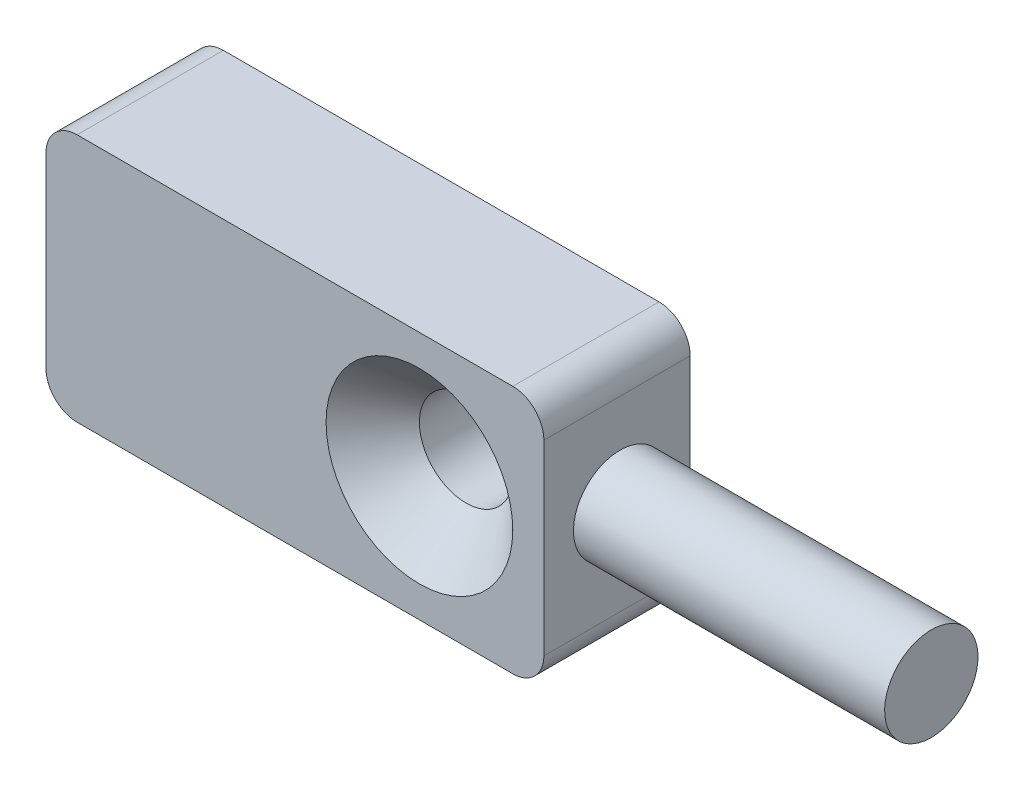
ISO-10303-21;
HEADER;
FILE_DESCRIPTION(('STEP AP214'),'2;1');
FILE_NAME('part.step','',(''),(''),'','','');
FILE_SCHEMA(('AUTOMOTIVE_DESIGN { 1 0 10303 214 1 1 1 1 }'));
ENDSEC;
DATA;
#1=APPLICATION_CONTEXT('core data for automotive mechanical design processes');
#2=APPLICATION_PROTOCOL_DEFINITION('international standard','automotive_design',2000,#1);
#3=PRODUCT_CONTEXT('',#1,'mechanical');
#4=PRODUCT('Part','Part','',(#3));
#5=PRODUCT_RELATED_PRODUCT_CATEGORY('part','',(#4));
#6=PRODUCT_DEFINITION_FORMATION('','',#4);
#7=PRODUCT_DEFINITION_CONTEXT('part definition',#1,'design');
#8=PRODUCT_DEFINITION('design','',#6,#7);
#9=PRODUCT_DEFINITION_SHAPE('','',#8);
#10=(LENGTH_UNIT() NAMED_UNIT(*) SI_UNIT(.MILLI.,.METRE.));
#11=(NAMED_UNIT(*) PLANE_ANGLE_UNIT() SI_UNIT($,.RADIAN.));
#12=(NAMED_UNIT(*) SI_UNIT($,.STERADIAN.) SOLID_ANGLE_UNIT());
#13=UNCERTAINTY_MEASURE_WITH_UNIT(LENGTH_MEASURE(1.E-05),#10,'distance_accuracy_value','');
#14=(GEOMETRIC_REPRESENTATION_CONTEXT(3) GLOBAL_UNCERTAINTY_ASSIGNED_CONTEXT((#13)) GLOBAL_UNIT_ASSIGNED_CONTEXT((#10,
#11,#12)) REPRESENTATION_CONTEXT('',''));
#15=CARTESIAN_POINT('',(0.,0.,0.));
#16=DIRECTION('',(0.,0.,1.));
#17=DIRECTION('',(1.,0.,0.));
#18=AXIS2_PLACEMENT_3D('',#15,#16,#17);
#19=CARTESIAN_POINT('',(0.,4.00000000000002,4.7));
#20=DIRECTION('',(-1.,0.,0.));
#21=DIRECTION('',(0.,-1.,0.));
#22=AXIS2_PLACEMENT_3D('',#19,#20,#21);
#23=PLANE('',#22);
#24=DIRECTION('',(0.,1.,0.));
#25=VECTOR('',#24,1.);
#26=CARTESIAN_POINT('',(0.,4.00000000000002,4.7));
#27=LINE('',#26,#25);
#28=CARTESIAN_POINT('',(0.,-2.99999999999999,4.7));
#29=VERTEX_POINT('',#28);
#30=CARTESIAN_POINT('',(0.,3.00000000000002,4.7));
#31=VERTEX_POINT('',#30);
#32=EDGE_CURVE('E133',#29,#31,#27,.T.);
#33=ORIENTED_EDGE('',*,*,#32,.F.);
#34=DIRECTION('',(0.,0.,-1.));
#35=VECTOR('',#34,1.);
#36=CARTESIAN_POINT('',(0.,-2.99999999999999,4.7));
#37=LINE('',#36,#35);
#38=CARTESIAN_POINT('',(0.,-2.99999999999999,0.));
#39=VERTEX_POINT('',#38);
#40=EDGE_CURVE('E116',#29,#39,#37,.T.);
#41=ORIENTED_EDGE('',*,*,#40,.T.);
#42=DIRECTION('',(0.,1.,0.));
#43=VECTOR('',#42,1.);
#44=CARTESIAN_POINT('',(0.,4.00000000000002,0.));
#45=LINE('',#44,#43);
#46=CARTESIAN_POINT('',(0.,3.00000000000002,0.));
#47=VERTEX_POINT('',#46);
#48=EDGE_CURVE('E130',#39,#47,#45,.T.);
#49=ORIENTED_EDGE('',*,*,#48,.T.);
#50=DIRECTION('',(0.,0.,-1.));
#51=VECTOR('',#50,1.);
#52=CARTESIAN_POINT('',(0.,3.00000000000002,4.7));
#53=LINE('',#52,#51);
#54=EDGE_CURVE('E136',#47,#31,#53,.F.);
#55=ORIENTED_EDGE('',*,*,#54,.T.);
#56=EDGE_LOOP('',(#33,#41,#49,#55));
#57=FACE_BOUND('',#56,.T.);
#58=CARTESIAN_POINT('',(0.,0.,2.25));
#59=DIRECTION('',(-1.,0.,0.));
#60=DIRECTION('',(0.,-1.,0.));
#61=AXIS2_PLACEMENT_3D('',#58,#59,#60);
#62=CIRCLE('',#61,1.5);
#63=CARTESIAN_POINT('',(0.,-1.5,2.25));
#64=VERTEX_POINT('',#63);
#65=EDGE_CURVE('E11',#64,#64,#62,.F.);
#66=ORIENTED_EDGE('',*,*,#65,.F.);
#67=EDGE_LOOP('',(#66));
#68=FACE_BOUND('',#67,.T.);
#69=ADVANCED_FACE('F44',(#57,#68),#23,.F.);
#70=CARTESIAN_POINT('',(0.,-3.99999999999999,4.7));
#71=DIRECTION('',(0.,0.,-1.));
#72=DIRECTION('',(-1.,0.,0.));
#73=AXIS2_PLACEMENT_3D('',#70,#71,#72);
#74=PLANE('',#73);
#75=CARTESIAN_POINT('',(-4.,0.,4.7));
#76=DIRECTION('',(0.,0.,-1.));
#77=DIRECTION('',(-1.,0.,0.));
#78=AXIS2_PLACEMENT_3D('',#75,#76,#77);
#79=CIRCLE('',#78,3.);
#80=CARTESIAN_POINT('',(-7.00000000000001,0.,4.7));
#81=VERTEX_POINT('',#80);
#82=EDGE_CURVE('E53',#81,#81,#79,.T.);
#83=ORIENTED_EDGE('',*,*,#82,.T.);
#84=EDGE_LOOP('',(#83));
#85=FACE_BOUND('',#84,.T.);
#86=DIRECTION('',(1.,0.,0.));
#87=VECTOR('',#86,1.);
#88=CARTESIAN_POINT('',(0.,-3.99999999999999,4.7));
#89=LINE('',#88,#87);
#90=CARTESIAN_POINT('',(-15.,-3.99999999999999,4.7));
#91=VERTEX_POINT('',#90);
#92=CARTESIAN_POINT('',(-0.999999999999999,-3.99999999999999,4.7));
#93=VERTEX_POINT('',#92);
#94=EDGE_CURVE('E156',#91,#93,#89,.T.);
#95=ORIENTED_EDGE('',*,*,#94,.T.);
#96=CARTESIAN_POINT('',(-0.999999999999999,-2.99999999999999,4.7));
#97=DIRECTION('',(0.,0.,-1.));
#98=DIRECTION('',(-1.,0.,0.));
#99=AXIS2_PLACEMENT_3D('',#96,#97,#98);
#100=CIRCLE('',#99,1.);
#101=EDGE_CURVE('E184',#93,#29,#100,.F.);
#102=ORIENTED_EDGE('',*,*,#101,.T.);
#103=ORIENTED_EDGE('',*,*,#32,.T.);
#104=CARTESIAN_POINT('',(-1.,3.00000000000002,4.7));
#105=DIRECTION('',(0.,0.,-1.));
#106=DIRECTION('',(-1.,0.,0.));
#107=AXIS2_PLACEMENT_3D('',#104,#105,#106);
#108=CIRCLE('',#107,1.);
#109=CARTESIAN_POINT('',(-1.,4.00000000000002,4.7));
#110=VERTEX_POINT('',#109);
#111=EDGE_CURVE('E178',#31,#110,#108,.F.);
#112=ORIENTED_EDGE('',*,*,#111,.T.);
#113=DIRECTION('',(-1.,0.,0.));
#114=VECTOR('',#113,1.);
#115=CARTESIAN_POINT('',(0.,4.00000000000002,4.7));
#116=LINE('',#115,#114);
#117=CARTESIAN_POINT('',(-15.,4.00000000000001,4.7));
#118=VERTEX_POINT('',#117);
#119=EDGE_CURVE('E263',#110,#118,#116,.T.);
#120=ORIENTED_EDGE('',*,*,#119,.T.);
#121=CARTESIAN_POINT('',(-15.,3.00000000000001,4.7));
#122=DIRECTION('',(0.,0.,-1.));
#123=DIRECTION('',(-1.,0.,0.));
#124=AXIS2_PLACEMENT_3D('',#121,#122,#123);
#125=CIRCLE('',#124,1.);
#126=CARTESIAN_POINT('',(-16.,3.00000000000001,4.7));
#127=VERTEX_POINT('',#126);
#128=EDGE_CURVE('E67',#118,#127,#125,.F.);
#129=ORIENTED_EDGE('',*,*,#128,.T.);
#130=DIRECTION('',(0.,-1.,0.));
#131=VECTOR('',#130,1.);
#132=CARTESIAN_POINT('',(-16.,4.00000000000001,4.7));
#133=LINE('',#132,#131);
#134=CARTESIAN_POINT('',(-16.,-2.99999999999999,4.7));
#135=VERTEX_POINT('',#134);
#136=EDGE_CURVE('E256',#127,#135,#133,.T.);
#137=ORIENTED_EDGE('',*,*,#136,.T.);
#138=CARTESIAN_POINT('',(-15.,-2.99999999999999,4.7));
#139=DIRECTION('',(0.,0.,-1.));
#140=DIRECTION('',(-1.,0.,0.));
#141=AXIS2_PLACEMENT_3D('',#138,#139,#140);
#142=CIRCLE('',#141,1.);
#143=EDGE_CURVE('E181',#135,#91,#142,.F.);
#144=ORIENTED_EDGE('',*,*,#143,.T.);
#145=EDGE_LOOP('',(#95,#102,#103,#112,#120,#129,#137,#144));
#146=FACE_BOUND('',#145,.T.);
#147=ADVANCED_FACE('F208',(#85,#146),#74,.F.);
#148=CARTESIAN_POINT('',(0.,-3.99999999999999,0.));
#149=DIRECTION('',(0.,0.,-1.));
#150=DIRECTION('',(-1.,0.,0.));
#151=AXIS2_PLACEMENT_3D('',#148,#149,#150);
#152=PLANE('',#151);
#153=ORIENTED_EDGE('',*,*,#48,.F.);
#154=CARTESIAN_POINT('',(-0.999999999999999,-2.99999999999999,0.));
#155=DIRECTION('',(0.,0.,-1.));
#156=DIRECTION('',(-1.,0.,0.));
#157=AXIS2_PLACEMENT_3D('',#154,#155,#156);
#158=CIRCLE('',#157,1.);
#159=CARTESIAN_POINT('',(-0.999999999999999,-3.99999999999999,0.));
#160=VERTEX_POINT('',#159);
#161=EDGE_CURVE('E112',#39,#160,#158,.T.);
#162=ORIENTED_EDGE('',*,*,#161,.T.);
#163=DIRECTION('',(1.,0.,0.));
#164=VECTOR('',#163,1.);
#165=CARTESIAN_POINT('',(0.,-3.99999999999999,0.));
#166=LINE('',#165,#164);
#167=CARTESIAN_POINT('',(-15.,-3.99999999999999,0.));
#168=VERTEX_POINT('',#167);
#169=EDGE_CURVE('E161',#168,#160,#166,.T.);
#170=ORIENTED_EDGE('',*,*,#169,.F.);
#171=CARTESIAN_POINT('',(-15.,-2.99999999999999,0.));
#172=DIRECTION('',(0.,0.,-1.));
#173=DIRECTION('',(-1.,0.,0.));
#174=AXIS2_PLACEMENT_3D('',#171,#172,#173);
#175=CIRCLE('',#174,1.);
#176=CARTESIAN_POINT('',(-16.,-2.99999999999999,0.));
#177=VERTEX_POINT('',#176);
#178=EDGE_CURVE('E124',#168,#177,#175,.T.);
#179=ORIENTED_EDGE('',*,*,#178,.T.);
#180=DIRECTION('',(0.,-1.,0.));
#181=VECTOR('',#180,1.);
#182=CARTESIAN_POINT('',(-16.,4.00000000000001,0.));
#183=LINE('',#182,#181);
#184=CARTESIAN_POINT('',(-16.,3.00000000000001,0.));
#185=VERTEX_POINT('',#184);
#186=EDGE_CURVE('E149',#185,#177,#183,.T.);
#187=ORIENTED_EDGE('',*,*,#186,.F.);
#188=CARTESIAN_POINT('',(-15.,3.00000000000001,0.));
#189=DIRECTION('',(0.,0.,-1.));
#190=DIRECTION('',(-1.,0.,0.));
#191=AXIS2_PLACEMENT_3D('',#188,#189,#190);
#192=CIRCLE('',#191,1.);
#193=CARTESIAN_POINT('',(-15.,4.00000000000001,0.));
#194=VERTEX_POINT('',#193);
#195=EDGE_CURVE('E135',#185,#194,#192,.T.);
#196=ORIENTED_EDGE('',*,*,#195,.T.);
#197=DIRECTION('',(-1.,0.,0.));
#198=VECTOR('',#197,1.);
#199=CARTESIAN_POINT('',(0.,4.00000000000002,0.));
#200=LINE('',#199,#198);
#201=CARTESIAN_POINT('',(-1.,4.00000000000002,0.));
#202=VERTEX_POINT('',#201);
#203=EDGE_CURVE('E143',#202,#194,#200,.T.);
#204=ORIENTED_EDGE('',*,*,#203,.F.);
#205=CARTESIAN_POINT('',(-1.,3.00000000000002,0.));
#206=DIRECTION('',(0.,0.,-1.));
#207=DIRECTION('',(-1.,0.,0.));
#208=AXIS2_PLACEMENT_3D('',#205,#206,#207);
#209=CIRCLE('',#208,1.);
#210=EDGE_CURVE('E141',#202,#47,#209,.T.);
#211=ORIENTED_EDGE('',*,*,#210,.T.);
#212=EDGE_LOOP('',(#153,#162,#170,#179,#187,#196,#204,#211));
#213=FACE_BOUND('',#212,.T.);
#214=CARTESIAN_POINT('',(-4.,0.,0.));
#215=DIRECTION('',(0.,0.,1.));
#216=DIRECTION('',(1.,0.,0.));
#217=AXIS2_PLACEMENT_3D('',#214,#215,#216);
#218=CIRCLE('',#217,1.5);
#219=CARTESIAN_POINT('',(-2.5,0.,0.));
#220=VERTEX_POINT('',#219);
#221=EDGE_CURVE('E144',#220,#220,#218,.T.);
#222=ORIENTED_EDGE('',*,*,#221,.T.);
#223=EDGE_LOOP('',(#222));
#224=FACE_BOUND('',#223,.T.);
#225=ADVANCED_FACE('F138',(#213,#224),#152,.T.);
#226=CARTESIAN_POINT('',(0.,4.00000000000002,4.7));
#227=DIRECTION('',(0.,-1.,0.));
#228=DIRECTION('',(1.,0.,0.));
#229=AXIS2_PLACEMENT_3D('',#226,#227,#228);
#230=PLANE('',#229);
#231=ORIENTED_EDGE('',*,*,#119,.F.);
#232=DIRECTION('',(0.,0.,-1.));
#233=VECTOR('',#232,1.);
#234=CARTESIAN_POINT('',(-1.,4.00000000000002,4.7));
#235=LINE('',#234,#233);
#236=EDGE_CURVE('E196',#110,#202,#235,.T.);
#237=ORIENTED_EDGE('',*,*,#236,.T.);
#238=ORIENTED_EDGE('',*,*,#203,.T.);
#239=DIRECTION('',(0.,0.,-1.));
#240=VECTOR('',#239,1.);
#241=CARTESIAN_POINT('',(-15.,4.00000000000001,4.7));
#242=LINE('',#241,#240);
#243=EDGE_CURVE('E193',#194,#118,#242,.F.);
#244=ORIENTED_EDGE('',*,*,#243,.T.);
#245=EDGE_LOOP('',(#231,#237,#238,#244));
#246=FACE_BOUND('',#245,.T.);
#247=ADVANCED_FACE('F223',(#246),#230,.F.);
#248=CARTESIAN_POINT('',(-16.,4.00000000000001,4.7));
#249=DIRECTION('',(1.,0.,0.));
#250=DIRECTION('',(0.,0.,-1.));
#251=AXIS2_PLACEMENT_3D('',#248,#249,#250);
#252=PLANE('',#251);
#253=ORIENTED_EDGE('',*,*,#186,.T.);
#254=DIRECTION('',(0.,0.,-1.));
#255=VECTOR('',#254,1.);
#256=CARTESIAN_POINT('',(-16.,-2.99999999999999,4.7));
#257=LINE('',#256,#255);
#258=EDGE_CURVE('E60',#177,#135,#257,.F.);
#259=ORIENTED_EDGE('',*,*,#258,.T.);
#260=ORIENTED_EDGE('',*,*,#136,.F.);
#261=DIRECTION('',(0.,0.,-1.));
#262=VECTOR('',#261,1.);
#263=CARTESIAN_POINT('',(-16.,3.00000000000001,4.7));
#264=LINE('',#263,#262);
#265=EDGE_CURVE('E187',#127,#185,#264,.T.);
#266=ORIENTED_EDGE('',*,*,#265,.T.);
#267=EDGE_LOOP('',(#253,#259,#260,#266));
#268=FACE_BOUND('',#267,.T.);
#269=ADVANCED_FACE('F229',(#268),#252,.F.);
#270=CARTESIAN_POINT('',(0.,-3.99999999999999,4.7));
#271=DIRECTION('',(0.,1.,0.));
#272=DIRECTION('',(-1.,0.,0.));
#273=AXIS2_PLACEMENT_3D('',#270,#271,#272);
#274=PLANE('',#273);
#275=ORIENTED_EDGE('',*,*,#169,.T.);
#276=DIRECTION('',(0.,0.,-1.));
#277=VECTOR('',#276,1.);
#278=CARTESIAN_POINT('',(-0.999999999999999,-3.99999999999999,4.7));
#279=LINE('',#278,#277);
#280=EDGE_CURVE('E117',#160,#93,#279,.F.);
#281=ORIENTED_EDGE('',*,*,#280,.T.);
#282=ORIENTED_EDGE('',*,*,#94,.F.);
#283=DIRECTION('',(0.,0.,-1.));
#284=VECTOR('',#283,1.);
#285=CARTESIAN_POINT('',(-15.,-3.99999999999999,4.7));
#286=LINE('',#285,#284);
#287=EDGE_CURVE('E123',#91,#168,#286,.T.);
#288=ORIENTED_EDGE('',*,*,#287,.T.);
#289=EDGE_LOOP('',(#275,#281,#282,#288));
#290=FACE_BOUND('',#289,.T.);
#291=ADVANCED_FACE('F219',(#290),#274,.F.);
#292=CARTESIAN_POINT('',(-4.,0.,4.7));
#293=DIRECTION('',(0.,0.,-1.));
#294=DIRECTION('',(-1.,0.,0.));
#295=AXIS2_PLACEMENT_3D('',#292,#293,#294);
#296=CYLINDRICAL_SURFACE('',#295,1.5);
#297=CARTESIAN_POINT('',(-4.,0.,3.2));
#298=DIRECTION('',(0.,0.,-1.));
#299=DIRECTION('',(-1.,0.,0.));
#300=AXIS2_PLACEMENT_3D('',#297,#298,#299);
#301=CIRCLE('',#300,1.5);
#302=CARTESIAN_POINT('',(-5.5,0.,3.2));
#303=VERTEX_POINT('',#302);
#304=EDGE_CURVE('E200',#303,#303,#301,.F.);
#305=ORIENTED_EDGE('',*,*,#304,.T.);
#306=EDGE_LOOP('',(#305));
#307=FACE_BOUND('',#306,.T.);
#308=ORIENTED_EDGE('',*,*,#221,.F.);
#309=EDGE_LOOP('',(#308));
#310=FACE_BOUND('',#309,.T.);
#311=ADVANCED_FACE('F216',(#307,#310),#296,.F.);
#312=CARTESIAN_POINT('',(-0.999999999999999,-2.99999999999999,4.7));
#313=DIRECTION('',(0.,0.,-1.));
#314=DIRECTION('',(-1.,0.,0.));
#315=AXIS2_PLACEMENT_3D('',#312,#313,#314);
#316=CYLINDRICAL_SURFACE('',#315,1.);
#317=ORIENTED_EDGE('',*,*,#101,.F.);
#318=ORIENTED_EDGE('',*,*,#280,.F.);
#319=ORIENTED_EDGE('',*,*,#161,.F.);
#320=ORIENTED_EDGE('',*,*,#40,.F.);
#321=EDGE_LOOP('',(#317,#318,#319,#320));
#322=FACE_BOUND('',#321,.T.);
#323=ADVANCED_FACE('F115',(#322),#316,.T.);
#324=CARTESIAN_POINT('',(-15.,-2.99999999999999,4.7));
#325=DIRECTION('',(0.,0.,-1.));
#326=DIRECTION('',(-1.,0.,0.));
#327=AXIS2_PLACEMENT_3D('',#324,#325,#326);
#328=CYLINDRICAL_SURFACE('',#327,1.);
#329=ORIENTED_EDGE('',*,*,#143,.F.);
#330=ORIENTED_EDGE('',*,*,#258,.F.);
#331=ORIENTED_EDGE('',*,*,#178,.F.);
#332=ORIENTED_EDGE('',*,*,#287,.F.);
#333=EDGE_LOOP('',(#329,#330,#331,#332));
#334=FACE_BOUND('',#333,.T.);
#335=ADVANCED_FACE('F242',(#334),#328,.T.);
#336=CARTESIAN_POINT('',(-1.,3.00000000000002,4.7));
#337=DIRECTION('',(0.,0.,-1.));
#338=DIRECTION('',(-1.,0.,0.));
#339=AXIS2_PLACEMENT_3D('',#336,#337,#338);
#340=CYLINDRICAL_SURFACE('',#339,1.);
#341=ORIENTED_EDGE('',*,*,#111,.F.);
#342=ORIENTED_EDGE('',*,*,#54,.F.);
#343=ORIENTED_EDGE('',*,*,#210,.F.);
#344=ORIENTED_EDGE('',*,*,#236,.F.);
#345=EDGE_LOOP('',(#341,#342,#343,#344));
#346=FACE_BOUND('',#345,.T.);
#347=ADVANCED_FACE('F245',(#346),#340,.T.);
#348=CARTESIAN_POINT('',(-15.,3.00000000000001,4.7));
#349=DIRECTION('',(0.,0.,-1.));
#350=DIRECTION('',(-1.,0.,0.));
#351=AXIS2_PLACEMENT_3D('',#348,#349,#350);
#352=CYLINDRICAL_SURFACE('',#351,1.);
#353=ORIENTED_EDGE('',*,*,#128,.F.);
#354=ORIENTED_EDGE('',*,*,#243,.F.);
#355=ORIENTED_EDGE('',*,*,#195,.F.);
#356=ORIENTED_EDGE('',*,*,#265,.F.);
#357=EDGE_LOOP('',(#353,#354,#355,#356));
#358=FACE_BOUND('',#357,.T.);
#359=ADVANCED_FACE('F213',(#358),#352,.T.);
#360=CARTESIAN_POINT('',(-4.,0.,3.2));
#361=DIRECTION('',(0.,0.,1.));
#362=DIRECTION('',(1.,0.,0.));
#363=AXIS2_PLACEMENT_3D('',#360,#361,#362);
#364=CONICAL_SURFACE('',#363,1.5,0.78539816339745);
#365=ORIENTED_EDGE('',*,*,#82,.F.);
#366=EDGE_LOOP('',(#365));
#367=FACE_BOUND('',#366,.T.);
#368=ORIENTED_EDGE('',*,*,#304,.F.);
#369=EDGE_LOOP('',(#368));
#370=FACE_BOUND('',#369,.T.);
#371=ADVANCED_FACE('F46',(#367,#370),#364,.F.);
#372=CARTESIAN_POINT('',(10.,0.,2.25));
#373=DIRECTION('',(-1.,0.,0.));
#374=DIRECTION('',(0.,0.,1.));
#375=AXIS2_PLACEMENT_3D('',#372,#373,#374);
#376=CYLINDRICAL_SURFACE('',#375,1.5);
#377=CARTESIAN_POINT('',(10.,0.,2.25));
#378=DIRECTION('',(1.,0.,0.));
#379=DIRECTION('',(0.,0.,-1.));
#380=AXIS2_PLACEMENT_3D('',#377,#378,#379);
#381=CIRCLE('',#380,1.5);
#382=CARTESIAN_POINT('',(10.,0.,0.749999999999998));
#383=VERTEX_POINT('',#382);
#384=EDGE_CURVE('E153',#383,#383,#381,.T.);
#385=ORIENTED_EDGE('',*,*,#384,.F.);
#386=EDGE_LOOP('',(#385));
#387=FACE_BOUND('',#386,.T.);
#388=ORIENTED_EDGE('',*,*,#65,.T.);
#389=EDGE_LOOP('',(#388));
#390=FACE_BOUND('',#389,.T.);
#391=ADVANCED_FACE('F212',(#387,#390),#376,.T.);
#392=CARTESIAN_POINT('',(10.,0.,2.25));
#393=DIRECTION('',(1.,0.,0.));
#394=DIRECTION('',(0.,0.,-1.));
#395=AXIS2_PLACEMENT_3D('',#392,#393,#394);
#396=PLANE('',#395);
#397=ORIENTED_EDGE('',*,*,#384,.T.);
#398=EDGE_LOOP('',(#397));
#399=FACE_BOUND('',#398,.T.);
#400=ADVANCED_FACE('F273',(#399),#396,.T.);
#401=CLOSED_SHELL('',(#69,#147,#225,#247,#269,#291,#311,#323,#335,#347,#359,#371,#391,#400));
#402=MANIFOLD_SOLID_BREP('B2',#401);
#403=ADVANCED_BREP_SHAPE_REPRESENTATION('',(#18,#402),#14);
#404=SHAPE_DEFINITION_REPRESENTATION(#9,#403);
ENDSEC;
END-ISO-10303-21;
